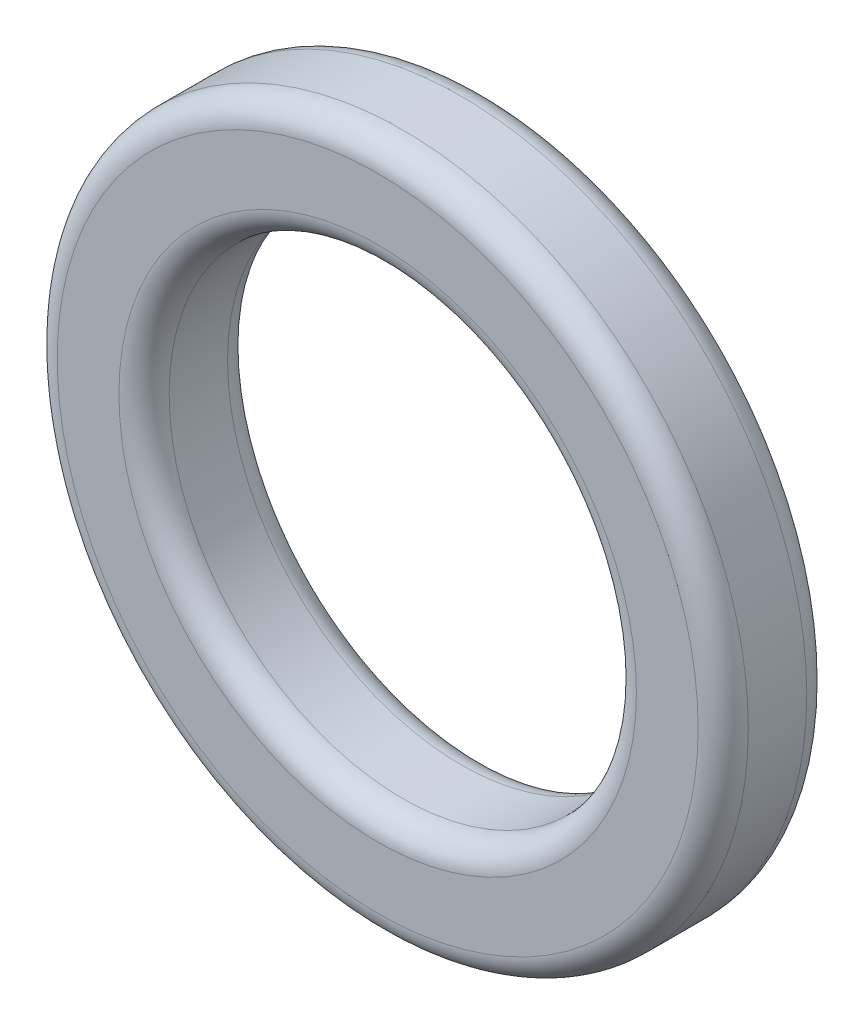
ISO-10303-21;
HEADER;
FILE_DESCRIPTION(('STEP AP214'),'2;1');
FILE_NAME('part.step','',(''),(''),'','','');
FILE_SCHEMA(('AUTOMOTIVE_DESIGN { 1 0 10303 214 1 1 1 1 }'));
ENDSEC;
DATA;
#1=APPLICATION_CONTEXT('core data for automotive mechanical design processes');
#2=APPLICATION_PROTOCOL_DEFINITION('international standard','automotive_design',2000,#1);
#3=PRODUCT_CONTEXT('',#1,'mechanical');
#4=PRODUCT('Part','Part','',(#3));
#5=PRODUCT_RELATED_PRODUCT_CATEGORY('part','',(#4));
#6=PRODUCT_DEFINITION_FORMATION('','',#4);
#7=PRODUCT_DEFINITION_CONTEXT('part definition',#1,'design');
#8=PRODUCT_DEFINITION('design','',#6,#7);
#9=PRODUCT_DEFINITION_SHAPE('','',#8);
#10=(LENGTH_UNIT() NAMED_UNIT(*) SI_UNIT(.MILLI.,.METRE.));
#11=(NAMED_UNIT(*) PLANE_ANGLE_UNIT() SI_UNIT($,.RADIAN.));
#12=(NAMED_UNIT(*) SI_UNIT($,.STERADIAN.) SOLID_ANGLE_UNIT());
#13=UNCERTAINTY_MEASURE_WITH_UNIT(LENGTH_MEASURE(1.E-05),#10,'distance_accuracy_value','');
#14=(GEOMETRIC_REPRESENTATION_CONTEXT(3) GLOBAL_UNCERTAINTY_ASSIGNED_CONTEXT((#13)) GLOBAL_UNIT_ASSIGNED_CONTEXT((#10,
#11,#12)) REPRESENTATION_CONTEXT('',''));
#15=CARTESIAN_POINT('',(0.,0.,0.));
#16=DIRECTION('',(0.,0.,1.));
#17=DIRECTION('',(1.,0.,0.));
#18=AXIS2_PLACEMENT_3D('',#15,#16,#17);
#19=CARTESIAN_POINT('',(0.,0.,4.33));
#20=DIRECTION('',(0.,0.,1.));
#21=DIRECTION('',(1.,0.,0.));
#22=AXIS2_PLACEMENT_3D('',#19,#20,#21);
#23=PLANE('',#22);
#24=CARTESIAN_POINT('',(0.,0.,4.33));
#25=DIRECTION('',(0.,0.,1.));
#26=DIRECTION('',(1.,0.,0.));
#27=AXIS2_PLACEMENT_3D('',#24,#25,#26);
#28=CIRCLE('',#27,10.315);
#29=CARTESIAN_POINT('',(10.315,0.,4.33));
#30=VERTEX_POINT('',#29);
#31=EDGE_CURVE('E10',#30,#30,#28,.F.);
#32=ORIENTED_EDGE('',*,*,#31,.T.);
#33=EDGE_LOOP('',(#32));
#34=FACE_BOUND('',#33,.T.);
#35=CARTESIAN_POINT('',(0.,0.,4.33));
#36=DIRECTION('',(0.,0.,1.));
#37=DIRECTION('',(1.,0.,0.));
#38=AXIS2_PLACEMENT_3D('',#35,#36,#37);
#39=CIRCLE('',#38,12.775);
#40=CARTESIAN_POINT('',(12.775,0.,4.33));
#41=VERTEX_POINT('',#40);
#42=EDGE_CURVE('E49',#41,#41,#39,.T.);
#43=ORIENTED_EDGE('',*,*,#42,.T.);
#44=EDGE_LOOP('',(#43));
#45=FACE_BOUND('',#44,.T.);
#46=ADVANCED_FACE('F41',(#34,#45),#23,.T.);
#47=CARTESIAN_POINT('',(0.,0.,0.));
#48=DIRECTION('',(0.,0.,1.));
#49=DIRECTION('',(1.,0.,0.));
#50=AXIS2_PLACEMENT_3D('',#47,#48,#49);
#51=PLANE('',#50);
#52=CARTESIAN_POINT('',(0.,0.,0.));
#53=DIRECTION('',(0.,0.,1.));
#54=DIRECTION('',(1.,0.,0.));
#55=AXIS2_PLACEMENT_3D('',#52,#53,#54);
#56=CIRCLE('',#55,10.315);
#57=CARTESIAN_POINT('',(10.315,0.,0.));
#58=VERTEX_POINT('',#57);
#59=EDGE_CURVE('E73',#58,#58,#56,.T.);
#60=ORIENTED_EDGE('',*,*,#59,.T.);
#61=EDGE_LOOP('',(#60));
#62=FACE_BOUND('',#61,.T.);
#63=CARTESIAN_POINT('',(0.,0.,0.));
#64=DIRECTION('',(0.,0.,1.));
#65=DIRECTION('',(1.,0.,0.));
#66=AXIS2_PLACEMENT_3D('',#63,#64,#65);
#67=CIRCLE('',#66,12.775);
#68=CARTESIAN_POINT('',(12.775,0.,0.));
#69=VERTEX_POINT('',#68);
#70=EDGE_CURVE('E77',#69,#69,#67,.F.);
#71=ORIENTED_EDGE('',*,*,#70,.T.);
#72=EDGE_LOOP('',(#71));
#73=FACE_BOUND('',#72,.T.);
#74=ADVANCED_FACE('F82',(#62,#73),#51,.F.);
#75=CARTESIAN_POINT('',(0.,0.,4.33));
#76=DIRECTION('',(0.,0.,-1.));
#77=DIRECTION('',(-1.,0.,0.));
#78=AXIS2_PLACEMENT_3D('',#75,#76,#77);
#79=CYLINDRICAL_SURFACE('',#78,13.775);
#80=CARTESIAN_POINT('',(0.,0.,1.));
#81=DIRECTION('',(0.,0.,1.));
#82=DIRECTION('',(1.,0.,0.));
#83=AXIS2_PLACEMENT_3D('',#80,#81,#82);
#84=CIRCLE('',#83,13.775);
#85=CARTESIAN_POINT('',(13.775,0.,1.));
#86=VERTEX_POINT('',#85);
#87=EDGE_CURVE('E54',#86,#86,#84,.T.);
#88=ORIENTED_EDGE('',*,*,#87,.T.);
#89=EDGE_LOOP('',(#88));
#90=FACE_BOUND('',#89,.T.);
#91=CARTESIAN_POINT('',(0.,0.,3.33));
#92=DIRECTION('',(0.,0.,1.));
#93=DIRECTION('',(1.,0.,0.));
#94=AXIS2_PLACEMENT_3D('',#91,#92,#93);
#95=CIRCLE('',#94,13.775);
#96=CARTESIAN_POINT('',(13.775,0.,3.33));
#97=VERTEX_POINT('',#96);
#98=EDGE_CURVE('E59',#97,#97,#95,.F.);
#99=ORIENTED_EDGE('',*,*,#98,.T.);
#100=EDGE_LOOP('',(#99));
#101=FACE_BOUND('',#100,.T.);
#102=ADVANCED_FACE('F92',(#90,#101),#79,.T.);
#103=CARTESIAN_POINT('',(0.,0.,4.33));
#104=DIRECTION('',(0.,0.,-1.));
#105=DIRECTION('',(-1.,0.,0.));
#106=AXIS2_PLACEMENT_3D('',#103,#104,#105);
#107=CYLINDRICAL_SURFACE('',#106,9.315);
#108=CARTESIAN_POINT('',(0.,0.,1.));
#109=DIRECTION('',(0.,0.,1.));
#110=DIRECTION('',(1.,0.,0.));
#111=AXIS2_PLACEMENT_3D('',#108,#109,#110);
#112=CIRCLE('',#111,9.315);
#113=CARTESIAN_POINT('',(9.315,0.,1.));
#114=VERTEX_POINT('',#113);
#115=EDGE_CURVE('E65',#114,#114,#112,.F.);
#116=ORIENTED_EDGE('',*,*,#115,.T.);
#117=EDGE_LOOP('',(#116));
#118=FACE_BOUND('',#117,.T.);
#119=CARTESIAN_POINT('',(0.,0.,3.33));
#120=DIRECTION('',(0.,0.,1.));
#121=DIRECTION('',(1.,0.,0.));
#122=AXIS2_PLACEMENT_3D('',#119,#120,#121);
#123=CIRCLE('',#122,9.315);
#124=CARTESIAN_POINT('',(9.315,0.,3.33));
#125=VERTEX_POINT('',#124);
#126=EDGE_CURVE('E69',#125,#125,#123,.T.);
#127=ORIENTED_EDGE('',*,*,#126,.T.);
#128=EDGE_LOOP('',(#127));
#129=FACE_BOUND('',#128,.T.);
#130=ADVANCED_FACE('F95',(#118,#129),#107,.F.);
#131=CARTESIAN_POINT('',(0.,0.,1.));
#132=DIRECTION('',(0.,0.,1.));
#133=DIRECTION('',(1.,0.,0.));
#134=AXIS2_PLACEMENT_3D('',#131,#132,#133);
#135=TOROIDAL_SURFACE('',#134,10.315,1.);
#136=ORIENTED_EDGE('',*,*,#115,.F.);
#137=EDGE_LOOP('',(#136));
#138=FACE_BOUND('',#137,.T.);
#139=ORIENTED_EDGE('',*,*,#59,.F.);
#140=EDGE_LOOP('',(#139));
#141=FACE_BOUND('',#140,.T.);
#142=ADVANCED_FACE('F88',(#138,#141),#135,.T.);
#143=CARTESIAN_POINT('',(0.,0.,1.));
#144=DIRECTION('',(0.,0.,1.));
#145=DIRECTION('',(1.,0.,0.));
#146=AXIS2_PLACEMENT_3D('',#143,#144,#145);
#147=TOROIDAL_SURFACE('',#146,12.775,1.);
#148=ORIENTED_EDGE('',*,*,#70,.F.);
#149=EDGE_LOOP('',(#148));
#150=FACE_BOUND('',#149,.T.);
#151=ORIENTED_EDGE('',*,*,#87,.F.);
#152=EDGE_LOOP('',(#151));
#153=FACE_BOUND('',#152,.T.);
#154=ADVANCED_FACE('F84',(#150,#153),#147,.T.);
#155=CARTESIAN_POINT('',(0.,0.,3.33));
#156=DIRECTION('',(0.,0.,1.));
#157=DIRECTION('',(1.,0.,0.));
#158=AXIS2_PLACEMENT_3D('',#155,#156,#157);
#159=TOROIDAL_SURFACE('',#158,10.315,1.);
#160=ORIENTED_EDGE('',*,*,#31,.F.);
#161=EDGE_LOOP('',(#160));
#162=FACE_BOUND('',#161,.T.);
#163=ORIENTED_EDGE('',*,*,#126,.F.);
#164=EDGE_LOOP('',(#163));
#165=FACE_BOUND('',#164,.T.);
#166=ADVANCED_FACE('F87',(#162,#165),#159,.T.);
#167=CARTESIAN_POINT('',(0.,0.,3.33));
#168=DIRECTION('',(0.,0.,1.));
#169=DIRECTION('',(1.,0.,0.));
#170=AXIS2_PLACEMENT_3D('',#167,#168,#169);
#171=TOROIDAL_SURFACE('',#170,12.775,1.);
#172=ORIENTED_EDGE('',*,*,#98,.F.);
#173=EDGE_LOOP('',(#172));
#174=FACE_BOUND('',#173,.T.);
#175=ORIENTED_EDGE('',*,*,#42,.F.);
#176=EDGE_LOOP('',(#175));
#177=FACE_BOUND('',#176,.T.);
#178=ADVANCED_FACE('F43',(#174,#177),#171,.T.);
#179=CLOSED_SHELL('',(#46,#74,#102,#130,#142,#154,#166,#178));
#180=MANIFOLD_SOLID_BREP('B2',#179);
#181=ADVANCED_BREP_SHAPE_REPRESENTATION('',(#18,#180),#14);
#182=SHAPE_DEFINITION_REPRESENTATION(#9,#181);
ENDSEC;
END-ISO-10303-21;
